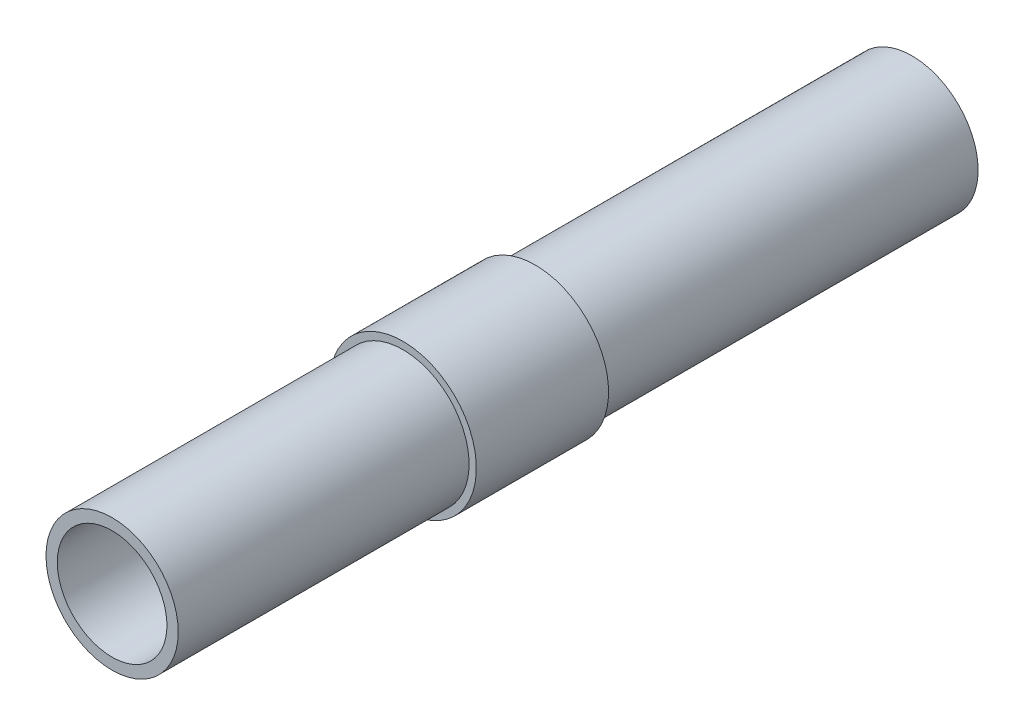
ISO-10303-21;
HEADER;
FILE_DESCRIPTION(('STEP AP214'),'2;1');
FILE_NAME('part.step','',(''),(''),'','','');
FILE_SCHEMA(('AUTOMOTIVE_DESIGN { 1 0 10303 214 1 1 1 1 }'));
ENDSEC;
DATA;
#1=APPLICATION_CONTEXT('core data for automotive mechanical design processes');
#2=APPLICATION_PROTOCOL_DEFINITION('international standard','automotive_design',2000,#1);
#3=PRODUCT_CONTEXT('',#1,'mechanical');
#4=PRODUCT('Part','Part','',(#3));
#5=PRODUCT_RELATED_PRODUCT_CATEGORY('part','',(#4));
#6=PRODUCT_DEFINITION_FORMATION('','',#4);
#7=PRODUCT_DEFINITION_CONTEXT('part definition',#1,'design');
#8=PRODUCT_DEFINITION('design','',#6,#7);
#9=PRODUCT_DEFINITION_SHAPE('','',#8);
#10=(LENGTH_UNIT() NAMED_UNIT(*) SI_UNIT(.MILLI.,.METRE.));
#11=(NAMED_UNIT(*) PLANE_ANGLE_UNIT() SI_UNIT($,.RADIAN.));
#12=(NAMED_UNIT(*) SI_UNIT($,.STERADIAN.) SOLID_ANGLE_UNIT());
#13=UNCERTAINTY_MEASURE_WITH_UNIT(LENGTH_MEASURE(1.E-05),#10,'distance_accuracy_value','');
#14=(GEOMETRIC_REPRESENTATION_CONTEXT(3) GLOBAL_UNCERTAINTY_ASSIGNED_CONTEXT((#13)) GLOBAL_UNIT_ASSIGNED_CONTEXT((#10,
#11,#12)) REPRESENTATION_CONTEXT('',''));
#15=CARTESIAN_POINT('',(0.,0.,0.));
#16=DIRECTION('',(0.,0.,1.));
#17=DIRECTION('',(1.,0.,0.));
#18=AXIS2_PLACEMENT_3D('',#15,#16,#17);
#19=CARTESIAN_POINT('',(0.,0.,24.));
#20=DIRECTION('',(0.,0.,-1.));
#21=DIRECTION('',(-1.,0.,0.));
#22=AXIS2_PLACEMENT_3D('',#19,#20,#21);
#23=CYLINDRICAL_SURFACE('',#22,10.);
#24=CARTESIAN_POINT('',(0.,0.,24.));
#25=DIRECTION('',(0.,0.,-1.));
#26=DIRECTION('',(-1.,0.,0.));
#27=AXIS2_PLACEMENT_3D('',#24,#25,#26);
#28=CIRCLE('',#27,10.);
#29=CARTESIAN_POINT('',(-10.,0.,24.));
#30=VERTEX_POINT('',#29);
#31=EDGE_CURVE('E39',#30,#30,#28,.T.);
#32=ORIENTED_EDGE('',*,*,#31,.T.);
#33=EDGE_LOOP('',(#32));
#34=FACE_BOUND('',#33,.T.);
#35=CARTESIAN_POINT('',(0.,0.,-33.));
#36=DIRECTION('',(0.,0.,-1.));
#37=DIRECTION('',(-1.,0.,0.));
#38=AXIS2_PLACEMENT_3D('',#35,#36,#37);
#39=CIRCLE('',#38,10.);
#40=CARTESIAN_POINT('',(-10.,0.,-33.));
#41=VERTEX_POINT('',#40);
#42=EDGE_CURVE('E51',#41,#41,#39,.T.);
#43=ORIENTED_EDGE('',*,*,#42,.F.);
#44=EDGE_LOOP('',(#43));
#45=FACE_BOUND('',#44,.T.);
#46=ADVANCED_FACE('F31',(#34,#45),#23,.T.);
#47=CARTESIAN_POINT('',(0.,0.,58.));
#48=DIRECTION('',(0.,0.,-1.));
#49=DIRECTION('',(-1.,0.,0.));
#50=AXIS2_PLACEMENT_3D('',#47,#48,#49);
#51=CYLINDRICAL_SURFACE('',#50,11.1);
#52=CARTESIAN_POINT('',(0.,0.,44.));
#53=DIRECTION('',(0.,0.,-1.));
#54=DIRECTION('',(-1.,0.,0.));
#55=AXIS2_PLACEMENT_3D('',#52,#53,#54);
#56=CIRCLE('',#55,11.1);
#57=CARTESIAN_POINT('',(-11.1,0.,44.));
#58=VERTEX_POINT('',#57);
#59=EDGE_CURVE('E35',#58,#58,#56,.T.);
#60=ORIENTED_EDGE('',*,*,#59,.T.);
#61=EDGE_LOOP('',(#60));
#62=FACE_BOUND('',#61,.T.);
#63=CARTESIAN_POINT('',(0.,0.,24.));
#64=DIRECTION('',(0.,0.,-1.));
#65=DIRECTION('',(-1.,0.,0.));
#66=AXIS2_PLACEMENT_3D('',#63,#64,#65);
#67=CIRCLE('',#66,11.1);
#68=CARTESIAN_POINT('',(-11.1,0.,24.));
#69=VERTEX_POINT('',#68);
#70=EDGE_CURVE('E10',#69,#69,#67,.T.);
#71=ORIENTED_EDGE('',*,*,#70,.F.);
#72=EDGE_LOOP('',(#71));
#73=FACE_BOUND('',#72,.T.);
#74=ADVANCED_FACE('F33',(#62,#73),#51,.T.);
#75=CARTESIAN_POINT('',(0.,0.,24.));
#76=DIRECTION('',(0.,0.,-1.));
#77=DIRECTION('',(-1.,0.,0.));
#78=AXIS2_PLACEMENT_3D('',#75,#76,#77);
#79=PLANE('',#78);
#80=ORIENTED_EDGE('',*,*,#31,.F.);
#81=EDGE_LOOP('',(#80));
#82=FACE_BOUND('',#81,.T.);
#83=ORIENTED_EDGE('',*,*,#70,.T.);
#84=EDGE_LOOP('',(#83));
#85=FACE_BOUND('',#84,.T.);
#86=ADVANCED_FACE('F82',(#82,#85),#79,.T.);
#87=CARTESIAN_POINT('',(0.,0.,44.));
#88=DIRECTION('',(0.,0.,-1.));
#89=DIRECTION('',(-1.,0.,0.));
#90=AXIS2_PLACEMENT_3D('',#87,#88,#89);
#91=PLANE('',#90);
#92=CARTESIAN_POINT('',(0.,0.,44.));
#93=DIRECTION('',(0.,0.,-1.));
#94=DIRECTION('',(-1.,0.,0.));
#95=AXIS2_PLACEMENT_3D('',#92,#93,#94);
#96=CIRCLE('',#95,10.);
#97=CARTESIAN_POINT('',(-10.,0.,44.));
#98=VERTEX_POINT('',#97);
#99=EDGE_CURVE('E45',#98,#98,#96,.T.);
#100=ORIENTED_EDGE('',*,*,#99,.T.);
#101=EDGE_LOOP('',(#100));
#102=FACE_BOUND('',#101,.T.);
#103=ORIENTED_EDGE('',*,*,#59,.F.);
#104=EDGE_LOOP('',(#103));
#105=FACE_BOUND('',#104,.T.);
#106=ADVANCED_FACE('F85',(#102,#105),#91,.F.);
#107=CARTESIAN_POINT('',(0.,0.,58.));
#108=DIRECTION('',(0.,0.,-1.));
#109=DIRECTION('',(-1.,0.,0.));
#110=AXIS2_PLACEMENT_3D('',#107,#108,#109);
#111=CYLINDRICAL_SURFACE('',#110,10.);
#112=ORIENTED_EDGE('',*,*,#99,.F.);
#113=EDGE_LOOP('',(#112));
#114=FACE_BOUND('',#113,.T.);
#115=CARTESIAN_POINT('',(0.,0.,88.));
#116=DIRECTION('',(0.,0.,1.));
#117=DIRECTION('',(1.,0.,0.));
#118=AXIS2_PLACEMENT_3D('',#115,#116,#117);
#119=CIRCLE('',#118,10.);
#120=CARTESIAN_POINT('',(10.,0.,88.));
#121=VERTEX_POINT('',#120);
#122=EDGE_CURVE('E48',#121,#121,#119,.T.);
#123=ORIENTED_EDGE('',*,*,#122,.F.);
#124=EDGE_LOOP('',(#123));
#125=FACE_BOUND('',#124,.T.);
#126=ADVANCED_FACE('F92',(#114,#125),#111,.T.);
#127=CARTESIAN_POINT('',(0.,0.,88.));
#128=DIRECTION('',(0.,0.,1.));
#129=DIRECTION('',(1.,0.,0.));
#130=AXIS2_PLACEMENT_3D('',#127,#128,#129);
#131=PLANE('',#130);
#132=CARTESIAN_POINT('',(0.,0.,88.));
#133=DIRECTION('',(0.,0.,-1.));
#134=DIRECTION('',(-1.,0.,0.));
#135=AXIS2_PLACEMENT_3D('',#132,#133,#134);
#136=CIRCLE('',#135,8.28744509912235);
#137=CARTESIAN_POINT('',(-8.28744509912235,0.,88.));
#138=VERTEX_POINT('',#137);
#139=EDGE_CURVE('E54',#138,#138,#136,.T.);
#140=ORIENTED_EDGE('',*,*,#139,.T.);
#141=EDGE_LOOP('',(#140));
#142=FACE_BOUND('',#141,.T.);
#143=ORIENTED_EDGE('',*,*,#122,.T.);
#144=EDGE_LOOP('',(#143));
#145=FACE_BOUND('',#144,.T.);
#146=ADVANCED_FACE('F61',(#142,#145),#131,.T.);
#147=CARTESIAN_POINT('',(0.,0.,-33.));
#148=DIRECTION('',(0.,0.,-1.));
#149=DIRECTION('',(-1.,0.,0.));
#150=AXIS2_PLACEMENT_3D('',#147,#148,#149);
#151=PLANE('',#150);
#152=CARTESIAN_POINT('',(0.,0.,-33.));
#153=DIRECTION('',(0.,0.,-1.));
#154=DIRECTION('',(-1.,0.,0.));
#155=AXIS2_PLACEMENT_3D('',#152,#153,#154);
#156=CIRCLE('',#155,8.28744509912235);
#157=CARTESIAN_POINT('',(-8.28744509912235,0.,-33.));
#158=VERTEX_POINT('',#157);
#159=EDGE_CURVE('E55',#158,#158,#156,.T.);
#160=ORIENTED_EDGE('',*,*,#159,.F.);
#161=EDGE_LOOP('',(#160));
#162=FACE_BOUND('',#161,.T.);
#163=ORIENTED_EDGE('',*,*,#42,.T.);
#164=EDGE_LOOP('',(#163));
#165=FACE_BOUND('',#164,.T.);
#166=ADVANCED_FACE('F67',(#162,#165),#151,.T.);
#167=CARTESIAN_POINT('',(0.,0.,88.));
#168=DIRECTION('',(0.,0.,-1.));
#169=DIRECTION('',(-1.,0.,0.));
#170=AXIS2_PLACEMENT_3D('',#167,#168,#169);
#171=CYLINDRICAL_SURFACE('',#170,8.28744509912235);
#172=ORIENTED_EDGE('',*,*,#139,.F.);
#173=EDGE_LOOP('',(#172));
#174=FACE_BOUND('',#173,.T.);
#175=ORIENTED_EDGE('',*,*,#159,.T.);
#176=EDGE_LOOP('',(#175));
#177=FACE_BOUND('',#176,.T.);
#178=ADVANCED_FACE('F64',(#174,#177),#171,.F.);
#179=CLOSED_SHELL('',(#46,#74,#86,#106,#126,#146,#166,#178));
#180=MANIFOLD_SOLID_BREP('B2',#179);
#181=ADVANCED_BREP_SHAPE_REPRESENTATION('',(#18,#180),#14);
#182=SHAPE_DEFINITION_REPRESENTATION(#9,#181);
ENDSEC;
END-ISO-10303-21;
